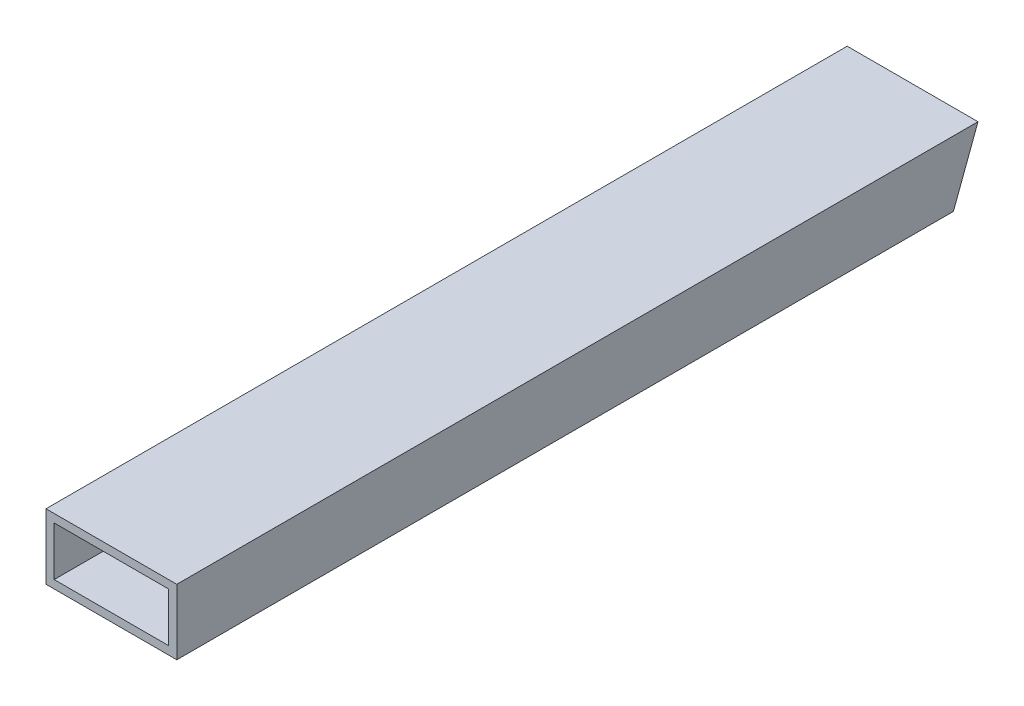
ISO-10303-21;
HEADER;
FILE_DESCRIPTION(('STEP AP214'),'2;1');
FILE_NAME('part.step','',(''),(''),'','','');
FILE_SCHEMA(('AUTOMOTIVE_DESIGN { 1 0 10303 214 1 1 1 1 }'));
ENDSEC;
DATA;
#1=APPLICATION_CONTEXT('core data for automotive mechanical design processes');
#2=APPLICATION_PROTOCOL_DEFINITION('international standard','automotive_design',2000,#1);
#3=PRODUCT_CONTEXT('',#1,'mechanical');
#4=PRODUCT('Part','Part','',(#3));
#5=PRODUCT_RELATED_PRODUCT_CATEGORY('part','',(#4));
#6=PRODUCT_DEFINITION_FORMATION('','',#4);
#7=PRODUCT_DEFINITION_CONTEXT('part definition',#1,'design');
#8=PRODUCT_DEFINITION('design','',#6,#7);
#9=PRODUCT_DEFINITION_SHAPE('','',#8);
#10=(LENGTH_UNIT() NAMED_UNIT(*) SI_UNIT(.MILLI.,.METRE.));
#11=(NAMED_UNIT(*) PLANE_ANGLE_UNIT() SI_UNIT($,.RADIAN.));
#12=(NAMED_UNIT(*) SI_UNIT($,.STERADIAN.) SOLID_ANGLE_UNIT());
#13=UNCERTAINTY_MEASURE_WITH_UNIT(LENGTH_MEASURE(1.E-05),#10,'distance_accuracy_value','');
#14=(GEOMETRIC_REPRESENTATION_CONTEXT(3) GLOBAL_UNCERTAINTY_ASSIGNED_CONTEXT((#13)) GLOBAL_UNIT_ASSIGNED_CONTEXT((#10,
#11,#12)) REPRESENTATION_CONTEXT('',''));
#15=CARTESIAN_POINT('',(0.,0.,0.));
#16=DIRECTION('',(0.,0.,1.));
#17=DIRECTION('',(1.,0.,0.));
#18=AXIS2_PLACEMENT_3D('',#15,#16,#17);
#19=CARTESIAN_POINT('',(-18.5952664732653,-5.32081349060378,0.));
#20=DIRECTION('',(-1.,0.,0.));
#21=DIRECTION('',(0.,0.,1.));
#22=AXIS2_PLACEMENT_3D('',#19,#20,#21);
#23=PLANE('',#22);
#24=DIRECTION('',(0.,-0.936059535738973,0.351841648404702));
#25=VECTOR('',#24,1.);
#26=CARTESIAN_POINT('',(-18.5952664732653,8.19123040551125,4.46838893473972));
#27=LINE('',#26,#25);
#28=CARTESIAN_POINT('',(-18.5952664732653,-2.14581349060378,8.3538282953565));
#29=VERTEX_POINT('',#28);
#30=CARTESIAN_POINT('',(-18.5952664732653,16.9041865093962,1.19340404219378));
#31=VERTEX_POINT('',#30);
#32=EDGE_CURVE('E105',#29,#31,#27,.F.);
#33=ORIENTED_EDGE('',*,*,#32,.T.);
#34=DIRECTION('',(0.,0.,1.));
#35=VECTOR('',#34,1.);
#36=CARTESIAN_POINT('',(-18.5952664732653,16.9041865093962,0.));
#37=LINE('',#36,#35);
#38=CARTESIAN_POINT('',(-18.5952664732653,16.9041865093962,311.15));
#39=VERTEX_POINT('',#38);
#40=EDGE_CURVE('E20',#31,#39,#37,.T.);
#41=ORIENTED_EDGE('',*,*,#40,.T.);
#42=DIRECTION('',(0.,1.,0.));
#43=VECTOR('',#42,1.);
#44=CARTESIAN_POINT('',(-18.5952664732653,7.37918650939622,311.15));
#45=LINE('',#44,#43);
#46=CARTESIAN_POINT('',(-18.5952664732653,-2.14581349060378,311.15));
#47=VERTEX_POINT('',#46);
#48=EDGE_CURVE('E117',#47,#39,#45,.T.);
#49=ORIENTED_EDGE('',*,*,#48,.F.);
#50=DIRECTION('',(0.,0.,-1.));
#51=VECTOR('',#50,1.);
#52=CARTESIAN_POINT('',(-18.5952664732653,-2.14581349060378,0.));
#53=LINE('',#52,#51);
#54=EDGE_CURVE('E101',#47,#29,#53,.T.);
#55=ORIENTED_EDGE('',*,*,#54,.T.);
#56=EDGE_LOOP('',(#33,#41,#49,#55));
#57=FACE_BOUND('',#56,.T.);
#58=ADVANCED_FACE('F17',(#57),#23,.F.);
#59=CARTESIAN_POINT('',(-21.7702664732653,16.9041865093962,0.));
#60=DIRECTION('',(0.,1.,0.));
#61=DIRECTION('',(0.,0.,1.));
#62=AXIS2_PLACEMENT_3D('',#59,#60,#61);
#63=PLANE('',#62);
#64=DIRECTION('',(1.,0.,0.));
#65=VECTOR('',#64,1.);
#66=CARTESIAN_POINT('',(3.62973352673468,16.9041865093962,1.19340404219379));
#67=LINE('',#66,#65);
#68=CARTESIAN_POINT('',(25.8547335267346,16.9041865093962,1.19340404219378));
#69=VERTEX_POINT('',#68);
#70=EDGE_CURVE('E107',#31,#69,#67,.T.);
#71=ORIENTED_EDGE('',*,*,#70,.T.);
#72=DIRECTION('',(0.,0.,-1.));
#73=VECTOR('',#72,1.);
#74=CARTESIAN_POINT('',(25.8547335267346,16.9041865093962,0.));
#75=LINE('',#74,#73);
#76=CARTESIAN_POINT('',(25.8547335267346,16.9041865093962,311.15));
#77=VERTEX_POINT('',#76);
#78=EDGE_CURVE('E79',#69,#77,#75,.F.);
#79=ORIENTED_EDGE('',*,*,#78,.T.);
#80=DIRECTION('',(1.,0.,0.));
#81=VECTOR('',#80,1.);
#82=CARTESIAN_POINT('',(3.62973352673468,16.9041865093962,311.15));
#83=LINE('',#82,#81);
#84=EDGE_CURVE('E119',#39,#77,#83,.T.);
#85=ORIENTED_EDGE('',*,*,#84,.F.);
#86=ORIENTED_EDGE('',*,*,#40,.F.);
#87=EDGE_LOOP('',(#71,#79,#85,#86));
#88=FACE_BOUND('',#87,.T.);
#89=ADVANCED_FACE('F120',(#88),#63,.F.);
#90=CARTESIAN_POINT('',(25.8547335267346,20.0791865093962,0.));
#91=DIRECTION('',(1.,0.,0.));
#92=DIRECTION('',(0.,0.,-1.));
#93=AXIS2_PLACEMENT_3D('',#90,#91,#92);
#94=PLANE('',#93);
#95=DIRECTION('',(0.,-0.936059535738973,0.351841648404702));
#96=VECTOR('',#95,1.);
#97=CARTESIAN_POINT('',(25.8547335267346,8.19123040551125,4.46838893473972));
#98=LINE('',#97,#96);
#99=CARTESIAN_POINT('',(25.8547335267346,-2.14581349060378,8.3538282953565));
#100=VERTEX_POINT('',#99);
#101=EDGE_CURVE('E82',#69,#100,#98,.T.);
#102=ORIENTED_EDGE('',*,*,#101,.T.);
#103=DIRECTION('',(0.,0.,-1.));
#104=VECTOR('',#103,1.);
#105=CARTESIAN_POINT('',(25.8547335267346,-2.14581349060378,0.));
#106=LINE('',#105,#104);
#107=CARTESIAN_POINT('',(25.8547335267346,-2.14581349060378,311.15));
#108=VERTEX_POINT('',#107);
#109=EDGE_CURVE('E85',#100,#108,#106,.F.);
#110=ORIENTED_EDGE('',*,*,#109,.T.);
#111=DIRECTION('',(0.,1.,0.));
#112=VECTOR('',#111,1.);
#113=CARTESIAN_POINT('',(25.8547335267346,7.37918650939622,311.15));
#114=LINE('',#113,#112);
#115=EDGE_CURVE('E122',#77,#108,#114,.F.);
#116=ORIENTED_EDGE('',*,*,#115,.F.);
#117=ORIENTED_EDGE('',*,*,#78,.F.);
#118=EDGE_LOOP('',(#102,#110,#116,#117));
#119=FACE_BOUND('',#118,.T.);
#120=ADVANCED_FACE('F84',(#119),#94,.F.);
#121=CARTESIAN_POINT('',(29.0297335267346,-2.14581349060378,0.));
#122=DIRECTION('',(0.,-1.,0.));
#123=DIRECTION('',(0.,0.,-1.));
#124=AXIS2_PLACEMENT_3D('',#121,#122,#123);
#125=PLANE('',#124);
#126=DIRECTION('',(1.,0.,0.));
#127=VECTOR('',#126,1.);
#128=CARTESIAN_POINT('',(3.62973352673468,-2.14581349060378,8.3538282953565));
#129=LINE('',#128,#127);
#130=EDGE_CURVE('E90',#100,#29,#129,.F.);
#131=ORIENTED_EDGE('',*,*,#130,.T.);
#132=ORIENTED_EDGE('',*,*,#54,.F.);
#133=DIRECTION('',(1.,0.,0.));
#134=VECTOR('',#133,1.);
#135=CARTESIAN_POINT('',(3.62973352673468,-2.14581349060378,311.15));
#136=LINE('',#135,#134);
#137=EDGE_CURVE('E99',#108,#47,#136,.F.);
#138=ORIENTED_EDGE('',*,*,#137,.F.);
#139=ORIENTED_EDGE('',*,*,#109,.F.);
#140=EDGE_LOOP('',(#131,#132,#138,#139));
#141=FACE_BOUND('',#140,.T.);
#142=ADVANCED_FACE('F95',(#141),#125,.F.);
#143=CARTESIAN_POINT('',(29.0297335267346,-5.32081349060378,0.));
#144=DIRECTION('',(0.,-1.,0.));
#145=DIRECTION('',(0.,0.,-1.));
#146=AXIS2_PLACEMENT_3D('',#143,#144,#145);
#147=PLANE('',#146);
#148=DIRECTION('',(1.,0.,0.));
#149=VECTOR('',#148,1.);
#150=CARTESIAN_POINT('',(3.62973352673468,-5.32081349060378,311.15));
#151=LINE('',#150,#149);
#152=CARTESIAN_POINT('',(-21.7702664732653,-5.32081349060378,311.15));
#153=VERTEX_POINT('',#152);
#154=CARTESIAN_POINT('',(29.0297335267346,-5.32081349060378,311.15));
#155=VERTEX_POINT('',#154);
#156=EDGE_CURVE('E125',#153,#155,#151,.T.);
#157=ORIENTED_EDGE('',*,*,#156,.F.);
#158=DIRECTION('',(0.,0.,1.));
#159=VECTOR('',#158,1.);
#160=CARTESIAN_POINT('',(-21.7702664732653,-5.32081349060378,0.));
#161=LINE('',#160,#159);
#162=CARTESIAN_POINT('',(-21.7702664732653,-5.32081349060378,9.54723233755028));
#163=VERTEX_POINT('',#162);
#164=EDGE_CURVE('E133',#163,#153,#161,.T.);
#165=ORIENTED_EDGE('',*,*,#164,.F.);
#166=DIRECTION('',(1.,0.,0.));
#167=VECTOR('',#166,1.);
#168=CARTESIAN_POINT('',(3.62973352673468,-5.32081349060378,9.54723233755029));
#169=LINE('',#168,#167);
#170=CARTESIAN_POINT('',(29.0297335267346,-5.32081349060378,9.54723233755028));
#171=VERTEX_POINT('',#170);
#172=EDGE_CURVE('E91',#163,#171,#169,.T.);
#173=ORIENTED_EDGE('',*,*,#172,.T.);
#174=DIRECTION('',(0.,0.,-1.));
#175=VECTOR('',#174,1.);
#176=CARTESIAN_POINT('',(29.0297335267346,-5.32081349060378,0.));
#177=LINE('',#176,#175);
#178=EDGE_CURVE('E153',#155,#171,#177,.T.);
#179=ORIENTED_EDGE('',*,*,#178,.F.);
#180=EDGE_LOOP('',(#157,#165,#173,#179));
#181=FACE_BOUND('',#180,.T.);
#182=ADVANCED_FACE('F152',(#181),#147,.T.);
#183=CARTESIAN_POINT('',(3.62973352673468,8.19123040551125,4.46838893473972));
#184=DIRECTION('',(0.,0.351841648404702,0.936059535738973));
#185=DIRECTION('',(0.,-0.936059535738973,0.351841648404702));
#186=AXIS2_PLACEMENT_3D('',#183,#184,#185);
#187=PLANE('',#186);
#188=ORIENTED_EDGE('',*,*,#32,.F.);
#189=ORIENTED_EDGE('',*,*,#130,.F.);
#190=ORIENTED_EDGE('',*,*,#101,.F.);
#191=ORIENTED_EDGE('',*,*,#70,.F.);
#192=EDGE_LOOP('',(#188,#189,#190,#191));
#193=FACE_BOUND('',#192,.T.);
#194=ORIENTED_EDGE('',*,*,#172,.F.);
#195=DIRECTION('',(0.,-0.936059535738973,0.351841648404702));
#196=VECTOR('',#195,1.);
#197=CARTESIAN_POINT('',(-21.7702664732653,20.0791865093962,0.));
#198=LINE('',#197,#196);
#199=CARTESIAN_POINT('',(-21.7702664732653,20.0791865093962,0.));
#200=VERTEX_POINT('',#199);
#201=EDGE_CURVE('E135',#200,#163,#198,.T.);
#202=ORIENTED_EDGE('',*,*,#201,.F.);
#203=DIRECTION('',(1.,0.,0.));
#204=VECTOR('',#203,1.);
#205=CARTESIAN_POINT('',(-21.7702664732653,20.0791865093962,0.));
#206=LINE('',#205,#204);
#207=CARTESIAN_POINT('',(29.0297335267346,20.0791865093962,0.));
#208=VERTEX_POINT('',#207);
#209=EDGE_CURVE('E146',#208,#200,#206,.F.);
#210=ORIENTED_EDGE('',*,*,#209,.F.);
#211=DIRECTION('',(0.,0.936059535738973,-0.351841648404702));
#212=VECTOR('',#211,1.);
#213=CARTESIAN_POINT('',(29.0297335267346,-5.32081349060378,9.54723233755027));
#214=LINE('',#213,#212);
#215=EDGE_CURVE('E148',#171,#208,#214,.T.);
#216=ORIENTED_EDGE('',*,*,#215,.F.);
#217=EDGE_LOOP('',(#194,#202,#210,#216));
#218=FACE_BOUND('',#217,.T.);
#219=ADVANCED_FACE('F103',(#193,#218),#187,.F.);
#220=CARTESIAN_POINT('',(-21.7702664732653,-5.32081349060378,0.));
#221=DIRECTION('',(-1.,0.,0.));
#222=DIRECTION('',(0.,0.,1.));
#223=AXIS2_PLACEMENT_3D('',#220,#221,#222);
#224=PLANE('',#223);
#225=DIRECTION('',(0.,1.,0.));
#226=VECTOR('',#225,1.);
#227=CARTESIAN_POINT('',(-21.7702664732653,7.37918650939622,311.15));
#228=LINE('',#227,#226);
#229=CARTESIAN_POINT('',(-21.7702664732653,20.0791865093962,311.15));
#230=VERTEX_POINT('',#229);
#231=EDGE_CURVE('E127',#230,#153,#228,.F.);
#232=ORIENTED_EDGE('',*,*,#231,.F.);
#233=DIRECTION('',(0.,0.,1.));
#234=VECTOR('',#233,1.);
#235=CARTESIAN_POINT('',(-21.7702664732653,20.0791865093962,0.));
#236=LINE('',#235,#234);
#237=EDGE_CURVE('E143',#200,#230,#236,.T.);
#238=ORIENTED_EDGE('',*,*,#237,.F.);
#239=ORIENTED_EDGE('',*,*,#201,.T.);
#240=ORIENTED_EDGE('',*,*,#164,.T.);
#241=EDGE_LOOP('',(#232,#238,#239,#240));
#242=FACE_BOUND('',#241,.T.);
#243=ADVANCED_FACE('F139',(#242),#224,.T.);
#244=CARTESIAN_POINT('',(3.62973352673468,7.37918650939622,311.15));
#245=DIRECTION('',(0.,0.,1.));
#246=DIRECTION('',(1.,0.,0.));
#247=AXIS2_PLACEMENT_3D('',#244,#245,#246);
#248=PLANE('',#247);
#249=ORIENTED_EDGE('',*,*,#115,.T.);
#250=ORIENTED_EDGE('',*,*,#137,.T.);
#251=ORIENTED_EDGE('',*,*,#48,.T.);
#252=ORIENTED_EDGE('',*,*,#84,.T.);
#253=EDGE_LOOP('',(#249,#250,#251,#252));
#254=FACE_BOUND('',#253,.T.);
#255=DIRECTION('',(0.,1.,0.));
#256=VECTOR('',#255,1.);
#257=CARTESIAN_POINT('',(29.0297335267346,20.0791865093962,311.15));
#258=LINE('',#257,#256);
#259=CARTESIAN_POINT('',(29.0297335267346,20.0791865093962,311.15));
#260=VERTEX_POINT('',#259);
#261=EDGE_CURVE('E35',#260,#155,#258,.F.);
#262=ORIENTED_EDGE('',*,*,#261,.F.);
#263=DIRECTION('',(1.,0.,0.));
#264=VECTOR('',#263,1.);
#265=CARTESIAN_POINT('',(-21.7702664732653,20.0791865093962,311.15));
#266=LINE('',#265,#264);
#267=EDGE_CURVE('E26',#230,#260,#266,.T.);
#268=ORIENTED_EDGE('',*,*,#267,.F.);
#269=ORIENTED_EDGE('',*,*,#231,.T.);
#270=ORIENTED_EDGE('',*,*,#156,.T.);
#271=EDGE_LOOP('',(#262,#268,#269,#270));
#272=FACE_BOUND('',#271,.T.);
#273=ADVANCED_FACE('F124',(#254,#272),#248,.T.);
#274=CARTESIAN_POINT('',(29.0297335267346,20.0791865093962,0.));
#275=DIRECTION('',(1.,0.,0.));
#276=DIRECTION('',(0.,0.,-1.));
#277=AXIS2_PLACEMENT_3D('',#274,#275,#276);
#278=PLANE('',#277);
#279=ORIENTED_EDGE('',*,*,#261,.T.);
#280=ORIENTED_EDGE('',*,*,#178,.T.);
#281=ORIENTED_EDGE('',*,*,#215,.T.);
#282=DIRECTION('',(0.,0.,1.));
#283=VECTOR('',#282,1.);
#284=CARTESIAN_POINT('',(29.0297335267346,20.0791865093962,0.));
#285=LINE('',#284,#283);
#286=EDGE_CURVE('E11',#260,#208,#285,.F.);
#287=ORIENTED_EDGE('',*,*,#286,.F.);
#288=EDGE_LOOP('',(#279,#280,#281,#287));
#289=FACE_BOUND('',#288,.T.);
#290=ADVANCED_FACE('F165',(#289),#278,.T.);
#291=CARTESIAN_POINT('',(-21.7702664732653,20.0791865093962,0.));
#292=DIRECTION('',(0.,1.,0.));
#293=DIRECTION('',(0.,0.,1.));
#294=AXIS2_PLACEMENT_3D('',#291,#292,#293);
#295=PLANE('',#294);
#296=ORIENTED_EDGE('',*,*,#267,.T.);
#297=ORIENTED_EDGE('',*,*,#286,.T.);
#298=ORIENTED_EDGE('',*,*,#209,.T.);
#299=ORIENTED_EDGE('',*,*,#237,.T.);
#300=EDGE_LOOP('',(#296,#297,#298,#299));
#301=FACE_BOUND('',#300,.T.);
#302=ADVANCED_FACE('F157',(#301),#295,.T.);
#303=CLOSED_SHELL('',(#58,#89,#120,#142,#182,#219,#243,#273,#290,#302));
#304=MANIFOLD_SOLID_BREP('B1',#303);
#305=ADVANCED_BREP_SHAPE_REPRESENTATION('',(#18,#304),#14);
#306=SHAPE_DEFINITION_REPRESENTATION(#9,#305);
ENDSEC;
END-ISO-10303-21;
